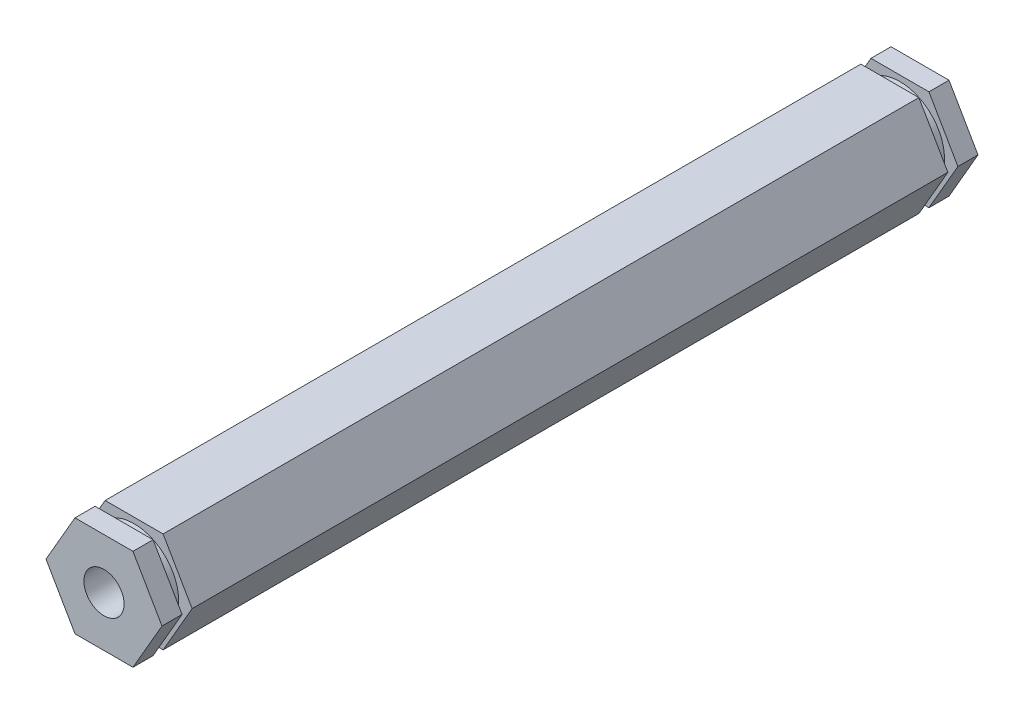
ISO-10303-21;
HEADER;
FILE_DESCRIPTION(('STEP AP214'),'2;1');
FILE_NAME('part.step','',(''),(''),'','','');
FILE_SCHEMA(('AUTOMOTIVE_DESIGN { 1 0 10303 214 1 1 1 1 }'));
ENDSEC;
DATA;
#1=APPLICATION_CONTEXT('core data for automotive mechanical design processes');
#2=APPLICATION_PROTOCOL_DEFINITION('international standard','automotive_design',2000,#1);
#3=PRODUCT_CONTEXT('',#1,'mechanical');
#4=PRODUCT('Part','Part','',(#3));
#5=PRODUCT_RELATED_PRODUCT_CATEGORY('part','',(#4));
#6=PRODUCT_DEFINITION_FORMATION('','',#4);
#7=PRODUCT_DEFINITION_CONTEXT('part definition',#1,'design');
#8=PRODUCT_DEFINITION('design','',#6,#7);
#9=PRODUCT_DEFINITION_SHAPE('','',#8);
#10=(LENGTH_UNIT() NAMED_UNIT(*) SI_UNIT(.MILLI.,.METRE.));
#11=(NAMED_UNIT(*) PLANE_ANGLE_UNIT() SI_UNIT($,.RADIAN.));
#12=(NAMED_UNIT(*) SI_UNIT($,.STERADIAN.) SOLID_ANGLE_UNIT());
#13=UNCERTAINTY_MEASURE_WITH_UNIT(LENGTH_MEASURE(1.E-05),#10,'distance_accuracy_value','');
#14=(GEOMETRIC_REPRESENTATION_CONTEXT(3) GLOBAL_UNCERTAINTY_ASSIGNED_CONTEXT((#13)) GLOBAL_UNIT_ASSIGNED_CONTEXT((#10,
#11,#12)) REPRESENTATION_CONTEXT('',''));
#15=CARTESIAN_POINT('',(0.,0.,0.));
#16=DIRECTION('',(0.,0.,1.));
#17=DIRECTION('',(1.,0.,0.));
#18=AXIS2_PLACEMENT_3D('',#15,#16,#17);
#19=CARTESIAN_POINT('',(3.66617420935412,-6.35000000000001,103.1875));
#20=DIRECTION('',(-0.866025403784439,0.5,0.));
#21=DIRECTION('',(-0.5,-0.866025403784439,0.));
#22=AXIS2_PLACEMENT_3D('',#19,#20,#21);
#23=PLANE('',#22);
#24=DIRECTION('',(0.5,0.866025403784439,0.));
#25=VECTOR('',#24,1.);
#26=CARTESIAN_POINT('',(3.66617420935412,-6.35000000000001,99.3775));
#27=LINE('',#26,#25);
#28=CARTESIAN_POINT('',(3.66617420935412,-6.35000000000001,99.3775));
#29=VERTEX_POINT('',#28);
#30=CARTESIAN_POINT('',(7.33234841870825,0.,99.3775));
#31=VERTEX_POINT('',#30);
#32=EDGE_CURVE('E381',#29,#31,#27,.T.);
#33=ORIENTED_EDGE('',*,*,#32,.F.);
#34=DIRECTION('',(0.,0.,-1.));
#35=VECTOR('',#34,1.);
#36=CARTESIAN_POINT('',(3.66617420935412,-6.35000000000001,103.1875));
#37=LINE('',#36,#35);
#38=CARTESIAN_POINT('',(3.66617420935412,-6.35000000000001,3.80999999999999));
#39=VERTEX_POINT('',#38);
#40=EDGE_CURVE('E244',#29,#39,#37,.T.);
#41=ORIENTED_EDGE('',*,*,#40,.T.);
#42=DIRECTION('',(0.5,0.866025403784439,0.));
#43=VECTOR('',#42,1.);
#44=CARTESIAN_POINT('',(3.66617420935412,-6.35000000000001,3.80999999999999));
#45=LINE('',#44,#43);
#46=CARTESIAN_POINT('',(7.33234841870825,0.,3.80999999999999));
#47=VERTEX_POINT('',#46);
#48=EDGE_CURVE('E272',#39,#47,#45,.T.);
#49=ORIENTED_EDGE('',*,*,#48,.T.);
#50=DIRECTION('',(0.,0.,-1.));
#51=VECTOR('',#50,1.);
#52=CARTESIAN_POINT('',(7.33234841870825,0.,103.1875));
#53=LINE('',#52,#51);
#54=EDGE_CURVE('E334',#31,#47,#53,.T.);
#55=ORIENTED_EDGE('',*,*,#54,.F.);
#56=EDGE_LOOP('',(#33,#41,#49,#55));
#57=FACE_BOUND('',#56,.T.);
#58=ADVANCED_FACE('F39',(#57),#23,.F.);
#59=CARTESIAN_POINT('',(7.33234841870825,0.,103.1875));
#60=DIRECTION('',(-0.866025403784439,-0.5,0.));
#61=DIRECTION('',(0.5,-0.866025403784439,0.));
#62=AXIS2_PLACEMENT_3D('',#59,#60,#61);
#63=PLANE('',#62);
#64=DIRECTION('',(-0.5,0.866025403784439,0.));
#65=VECTOR('',#64,1.);
#66=CARTESIAN_POINT('',(7.33234841870825,0.,99.3775));
#67=LINE('',#66,#65);
#68=CARTESIAN_POINT('',(3.66617420935412,6.35000000000001,99.3775));
#69=VERTEX_POINT('',#68);
#70=EDGE_CURVE('E384',#31,#69,#67,.T.);
#71=ORIENTED_EDGE('',*,*,#70,.F.);
#72=ORIENTED_EDGE('',*,*,#54,.T.);
#73=DIRECTION('',(-0.5,0.866025403784439,0.));
#74=VECTOR('',#73,1.);
#75=CARTESIAN_POINT('',(7.33234841870825,0.,3.80999999999999));
#76=LINE('',#75,#74);
#77=CARTESIAN_POINT('',(3.66617420935412,6.35000000000001,3.80999999999999));
#78=VERTEX_POINT('',#77);
#79=EDGE_CURVE('E370',#47,#78,#76,.T.);
#80=ORIENTED_EDGE('',*,*,#79,.T.);
#81=DIRECTION('',(0.,0.,-1.));
#82=VECTOR('',#81,1.);
#83=CARTESIAN_POINT('',(3.66617420935412,6.35000000000001,103.1875));
#84=LINE('',#83,#82);
#85=EDGE_CURVE('E328',#69,#78,#84,.T.);
#86=ORIENTED_EDGE('',*,*,#85,.F.);
#87=EDGE_LOOP('',(#71,#72,#80,#86));
#88=FACE_BOUND('',#87,.T.);
#89=ADVANCED_FACE('F453',(#88),#63,.F.);
#90=CARTESIAN_POINT('',(3.66617420935412,6.35000000000001,103.1875));
#91=DIRECTION('',(0.,-1.,0.));
#92=DIRECTION('',(0.,0.,-1.));
#93=AXIS2_PLACEMENT_3D('',#90,#91,#92);
#94=PLANE('',#93);
#95=DIRECTION('',(-1.,0.,0.));
#96=VECTOR('',#95,1.);
#97=CARTESIAN_POINT('',(3.66617420935412,6.35000000000001,99.3775));
#98=LINE('',#97,#96);
#99=CARTESIAN_POINT('',(-3.66617420935412,6.35000000000001,99.3775));
#100=VERTEX_POINT('',#99);
#101=EDGE_CURVE('E390',#69,#100,#98,.T.);
#102=ORIENTED_EDGE('',*,*,#101,.F.);
#103=ORIENTED_EDGE('',*,*,#85,.T.);
#104=DIRECTION('',(-1.,0.,0.));
#105=VECTOR('',#104,1.);
#106=CARTESIAN_POINT('',(3.66617420935412,6.35000000000001,3.80999999999999));
#107=LINE('',#106,#105);
#108=CARTESIAN_POINT('',(-3.66617420935412,6.35000000000001,3.80999999999999));
#109=VERTEX_POINT('',#108);
#110=EDGE_CURVE('E361',#78,#109,#107,.T.);
#111=ORIENTED_EDGE('',*,*,#110,.T.);
#112=DIRECTION('',(0.,0.,-1.));
#113=VECTOR('',#112,1.);
#114=CARTESIAN_POINT('',(-3.66617420935412,6.35000000000001,103.1875));
#115=LINE('',#114,#113);
#116=EDGE_CURVE('E316',#100,#109,#115,.T.);
#117=ORIENTED_EDGE('',*,*,#116,.F.);
#118=EDGE_LOOP('',(#102,#103,#111,#117));
#119=FACE_BOUND('',#118,.T.);
#120=ADVANCED_FACE('F432',(#119),#94,.F.);
#121=CARTESIAN_POINT('',(-3.66617420935412,6.35000000000001,103.1875));
#122=DIRECTION('',(0.866025403784439,-0.5,0.));
#123=DIRECTION('',(0.5,0.866025403784439,0.));
#124=AXIS2_PLACEMENT_3D('',#121,#122,#123);
#125=PLANE('',#124);
#126=DIRECTION('',(-0.5,-0.866025403784439,0.));
#127=VECTOR('',#126,1.);
#128=CARTESIAN_POINT('',(-3.66617420935412,6.35000000000001,99.3775));
#129=LINE('',#128,#127);
#130=CARTESIAN_POINT('',(-7.33234841870825,0.,99.3775));
#131=VERTEX_POINT('',#130);
#132=EDGE_CURVE('E437',#100,#131,#129,.T.);
#133=ORIENTED_EDGE('',*,*,#132,.F.);
#134=ORIENTED_EDGE('',*,*,#116,.T.);
#135=DIRECTION('',(-0.5,-0.866025403784439,0.));
#136=VECTOR('',#135,1.);
#137=CARTESIAN_POINT('',(-3.66617420935412,6.35000000000001,3.80999999999999));
#138=LINE('',#137,#136);
#139=CARTESIAN_POINT('',(-7.33234841870825,0.,3.80999999999999));
#140=VERTEX_POINT('',#139);
#141=EDGE_CURVE('E356',#109,#140,#138,.T.);
#142=ORIENTED_EDGE('',*,*,#141,.T.);
#143=DIRECTION('',(0.,0.,-1.));
#144=VECTOR('',#143,1.);
#145=CARTESIAN_POINT('',(-7.33234841870825,0.,103.1875));
#146=LINE('',#145,#144);
#147=EDGE_CURVE('E230',#131,#140,#146,.T.);
#148=ORIENTED_EDGE('',*,*,#147,.F.);
#149=EDGE_LOOP('',(#133,#134,#142,#148));
#150=FACE_BOUND('',#149,.T.);
#151=ADVANCED_FACE('F436',(#150),#125,.F.);
#152=CARTESIAN_POINT('',(-7.33234841870825,0.,103.1875));
#153=DIRECTION('',(0.866025403784438,0.5,0.));
#154=DIRECTION('',(-0.5,0.866025403784439,0.));
#155=AXIS2_PLACEMENT_3D('',#152,#153,#154);
#156=PLANE('',#155);
#157=DIRECTION('',(0.5,-0.866025403784439,0.));
#158=VECTOR('',#157,1.);
#159=CARTESIAN_POINT('',(-7.33234841870825,0.,99.3775));
#160=LINE('',#159,#158);
#161=CARTESIAN_POINT('',(-3.66617420935413,-6.35000000000001,99.3775));
#162=VERTEX_POINT('',#161);
#163=EDGE_CURVE('E68',#131,#162,#160,.T.);
#164=ORIENTED_EDGE('',*,*,#163,.F.);
#165=ORIENTED_EDGE('',*,*,#147,.T.);
#166=DIRECTION('',(0.5,-0.866025403784439,0.));
#167=VECTOR('',#166,1.);
#168=CARTESIAN_POINT('',(-7.33234841870825,0.,3.80999999999999));
#169=LINE('',#168,#167);
#170=CARTESIAN_POINT('',(-3.66617420935413,-6.35000000000001,3.80999999999999));
#171=VERTEX_POINT('',#170);
#172=EDGE_CURVE('E348',#140,#171,#169,.T.);
#173=ORIENTED_EDGE('',*,*,#172,.T.);
#174=DIRECTION('',(0.,0.,-1.));
#175=VECTOR('',#174,1.);
#176=CARTESIAN_POINT('',(-3.66617420935413,-6.35000000000001,103.1875));
#177=LINE('',#176,#175);
#178=EDGE_CURVE('E224',#162,#171,#177,.T.);
#179=ORIENTED_EDGE('',*,*,#178,.F.);
#180=EDGE_LOOP('',(#164,#165,#173,#179));
#181=FACE_BOUND('',#180,.T.);
#182=ADVANCED_FACE('F353',(#181),#156,.F.);
#183=CARTESIAN_POINT('',(-3.66617420935413,-6.35000000000001,103.1875));
#184=DIRECTION('',(0.,1.,0.));
#185=DIRECTION('',(0.,0.,1.));
#186=AXIS2_PLACEMENT_3D('',#183,#184,#185);
#187=PLANE('',#186);
#188=DIRECTION('',(1.,0.,0.));
#189=VECTOR('',#188,1.);
#190=CARTESIAN_POINT('',(-3.66617420935413,-6.35000000000001,99.3775));
#191=LINE('',#190,#189);
#192=EDGE_CURVE('E11',#162,#29,#191,.T.);
#193=ORIENTED_EDGE('',*,*,#192,.F.);
#194=ORIENTED_EDGE('',*,*,#178,.T.);
#195=DIRECTION('',(1.,0.,0.));
#196=VECTOR('',#195,1.);
#197=CARTESIAN_POINT('',(-3.66617420935413,-6.35000000000001,3.80999999999999));
#198=LINE('',#197,#196);
#199=EDGE_CURVE('E206',#171,#39,#198,.T.);
#200=ORIENTED_EDGE('',*,*,#199,.T.);
#201=ORIENTED_EDGE('',*,*,#40,.F.);
#202=EDGE_LOOP('',(#193,#194,#200,#201));
#203=FACE_BOUND('',#202,.T.);
#204=ADVANCED_FACE('F340',(#203),#187,.F.);
#205=CARTESIAN_POINT('',(0.,0.,3.81));
#206=DIRECTION('',(0.,0.,1.));
#207=DIRECTION('',(1.,0.,0.));
#208=AXIS2_PLACEMENT_3D('',#205,#206,#207);
#209=PLANE('',#208);
#210=CARTESIAN_POINT('',(0.,0.,3.81));
#211=DIRECTION('',(0.,0.,1.));
#212=DIRECTION('',(1.,0.,0.));
#213=AXIS2_PLACEMENT_3D('',#210,#211,#212);
#214=CIRCLE('',#213,5.63529717744261);
#215=CARTESIAN_POINT('',(5.63529717744261,0.,3.81));
#216=VERTEX_POINT('',#215);
#217=EDGE_CURVE('E398',#216,#216,#214,.T.);
#218=ORIENTED_EDGE('',*,*,#217,.T.);
#219=EDGE_LOOP('',(#218));
#220=FACE_BOUND('',#219,.T.);
#221=ORIENTED_EDGE('',*,*,#199,.F.);
#222=ORIENTED_EDGE('',*,*,#172,.F.);
#223=ORIENTED_EDGE('',*,*,#141,.F.);
#224=ORIENTED_EDGE('',*,*,#110,.F.);
#225=ORIENTED_EDGE('',*,*,#79,.F.);
#226=ORIENTED_EDGE('',*,*,#48,.F.);
#227=EDGE_LOOP('',(#221,#222,#223,#224,#225,#226));
#228=FACE_BOUND('',#227,.T.);
#229=ADVANCED_FACE('F346',(#220,#228),#209,.F.);
#230=CARTESIAN_POINT('',(0.,0.,2.54));
#231=DIRECTION('',(0.,0.,1.));
#232=DIRECTION('',(1.,0.,0.));
#233=AXIS2_PLACEMENT_3D('',#230,#231,#232);
#234=PLANE('',#233);
#235=CARTESIAN_POINT('',(0.,0.,2.54));
#236=DIRECTION('',(0.,0.,1.));
#237=DIRECTION('',(1.,0.,0.));
#238=AXIS2_PLACEMENT_3D('',#235,#236,#237);
#239=CIRCLE('',#238,5.63529717744261);
#240=CARTESIAN_POINT('',(5.63529717744261,0.,2.54));
#241=VERTEX_POINT('',#240);
#242=EDGE_CURVE('E396',#241,#241,#239,.T.);
#243=ORIENTED_EDGE('',*,*,#242,.F.);
#244=EDGE_LOOP('',(#243));
#245=FACE_BOUND('',#244,.T.);
#246=DIRECTION('',(0.5,0.866025403784439,0.));
#247=VECTOR('',#246,1.);
#248=CARTESIAN_POINT('',(3.66617420935412,-6.35000000000001,2.54));
#249=LINE('',#248,#247);
#250=CARTESIAN_POINT('',(3.66617420935412,-6.35000000000001,2.54));
#251=VERTEX_POINT('',#250);
#252=CARTESIAN_POINT('',(7.33234841870825,0.,2.54));
#253=VERTEX_POINT('',#252);
#254=EDGE_CURVE('E357',#251,#253,#249,.T.);
#255=ORIENTED_EDGE('',*,*,#254,.T.);
#256=DIRECTION('',(-0.5,0.866025403784439,0.));
#257=VECTOR('',#256,1.);
#258=CARTESIAN_POINT('',(7.33234841870825,0.,2.54));
#259=LINE('',#258,#257);
#260=CARTESIAN_POINT('',(3.66617420935412,6.35000000000001,2.54));
#261=VERTEX_POINT('',#260);
#262=EDGE_CURVE('E364',#253,#261,#259,.T.);
#263=ORIENTED_EDGE('',*,*,#262,.T.);
#264=DIRECTION('',(-1.,0.,0.));
#265=VECTOR('',#264,1.);
#266=CARTESIAN_POINT('',(3.66617420935412,6.35000000000001,2.54));
#267=LINE('',#266,#265);
#268=CARTESIAN_POINT('',(-3.66617420935412,6.35000000000001,2.54));
#269=VERTEX_POINT('',#268);
#270=EDGE_CURVE('E409',#261,#269,#267,.T.);
#271=ORIENTED_EDGE('',*,*,#270,.T.);
#272=DIRECTION('',(-0.5,-0.866025403784439,0.));
#273=VECTOR('',#272,1.);
#274=CARTESIAN_POINT('',(-3.66617420935412,6.35000000000001,2.54));
#275=LINE('',#274,#273);
#276=CARTESIAN_POINT('',(-7.33234841870825,0.,2.54));
#277=VERTEX_POINT('',#276);
#278=EDGE_CURVE('E406',#269,#277,#275,.T.);
#279=ORIENTED_EDGE('',*,*,#278,.T.);
#280=DIRECTION('',(0.5,-0.866025403784439,0.));
#281=VECTOR('',#280,1.);
#282=CARTESIAN_POINT('',(-7.33234841870825,0.,2.54));
#283=LINE('',#282,#281);
#284=CARTESIAN_POINT('',(-3.66617420935413,-6.35000000000001,2.54));
#285=VERTEX_POINT('',#284);
#286=EDGE_CURVE('E401',#277,#285,#283,.T.);
#287=ORIENTED_EDGE('',*,*,#286,.T.);
#288=DIRECTION('',(1.,0.,0.));
#289=VECTOR('',#288,1.);
#290=CARTESIAN_POINT('',(-3.66617420935413,-6.35000000000001,2.54));
#291=LINE('',#290,#289);
#292=EDGE_CURVE('E333',#285,#251,#291,.T.);
#293=ORIENTED_EDGE('',*,*,#292,.T.);
#294=EDGE_LOOP('',(#255,#263,#271,#279,#287,#293));
#295=FACE_BOUND('',#294,.T.);
#296=ADVANCED_FACE('F415',(#245,#295),#234,.T.);
#297=CARTESIAN_POINT('',(0.,0.,3.81));
#298=DIRECTION('',(0.,0.,-1.));
#299=DIRECTION('',(-1.,0.,0.));
#300=AXIS2_PLACEMENT_3D('',#297,#298,#299);
#301=CYLINDRICAL_SURFACE('',#300,5.63529717744261);
#302=ORIENTED_EDGE('',*,*,#217,.F.);
#303=EDGE_LOOP('',(#302));
#304=FACE_BOUND('',#303,.T.);
#305=ORIENTED_EDGE('',*,*,#242,.T.);
#306=EDGE_LOOP('',(#305));
#307=FACE_BOUND('',#306,.T.);
#308=ADVANCED_FACE('F500',(#304,#307),#301,.T.);
#309=CARTESIAN_POINT('',(0.,0.,0.));
#310=DIRECTION('',(0.,0.,1.));
#311=DIRECTION('',(1.,0.,0.));
#312=AXIS2_PLACEMENT_3D('',#309,#310,#311);
#313=PLANE('',#312);
#314=CARTESIAN_POINT('',(0.,0.,0.));
#315=DIRECTION('',(0.,0.,-1.));
#316=DIRECTION('',(-1.,0.,0.));
#317=AXIS2_PLACEMENT_3D('',#314,#315,#316);
#318=CIRCLE('',#317,2.54);
#319=CARTESIAN_POINT('',(-2.54,0.,0.));
#320=VERTEX_POINT('',#319);
#321=EDGE_CURVE('E383',#320,#320,#318,.T.);
#322=ORIENTED_EDGE('',*,*,#321,.F.);
#323=EDGE_LOOP('',(#322));
#324=FACE_BOUND('',#323,.T.);
#325=DIRECTION('',(0.5,0.866025403784439,0.));
#326=VECTOR('',#325,1.);
#327=CARTESIAN_POINT('',(3.66617420935412,-6.35000000000001,0.));
#328=LINE('',#327,#326);
#329=CARTESIAN_POINT('',(3.66617420935412,-6.35000000000001,0.));
#330=VERTEX_POINT('',#329);
#331=CARTESIAN_POINT('',(7.33234841870825,0.,0.));
#332=VERTEX_POINT('',#331);
#333=EDGE_CURVE('E268',#330,#332,#328,.T.);
#334=ORIENTED_EDGE('',*,*,#333,.F.);
#335=DIRECTION('',(1.,0.,0.));
#336=VECTOR('',#335,1.);
#337=CARTESIAN_POINT('',(-3.66617420935413,-6.35000000000001,0.));
#338=LINE('',#337,#336);
#339=CARTESIAN_POINT('',(-3.66617420935413,-6.35000000000001,0.));
#340=VERTEX_POINT('',#339);
#341=EDGE_CURVE('E286',#340,#330,#338,.T.);
#342=ORIENTED_EDGE('',*,*,#341,.F.);
#343=DIRECTION('',(0.5,-0.866025403784439,0.));
#344=VECTOR('',#343,1.);
#345=CARTESIAN_POINT('',(-7.33234841870825,0.,0.));
#346=LINE('',#345,#344);
#347=CARTESIAN_POINT('',(-7.33234841870825,0.,0.));
#348=VERTEX_POINT('',#347);
#349=EDGE_CURVE('E284',#348,#340,#346,.T.);
#350=ORIENTED_EDGE('',*,*,#349,.F.);
#351=DIRECTION('',(-0.5,-0.866025403784439,0.));
#352=VECTOR('',#351,1.);
#353=CARTESIAN_POINT('',(-3.66617420935412,6.35000000000001,0.));
#354=LINE('',#353,#352);
#355=CARTESIAN_POINT('',(-3.66617420935412,6.35000000000001,0.));
#356=VERTEX_POINT('',#355);
#357=EDGE_CURVE('E280',#356,#348,#354,.T.);
#358=ORIENTED_EDGE('',*,*,#357,.F.);
#359=DIRECTION('',(-1.,0.,0.));
#360=VECTOR('',#359,1.);
#361=CARTESIAN_POINT('',(3.66617420935412,6.35000000000001,0.));
#362=LINE('',#361,#360);
#363=CARTESIAN_POINT('',(3.66617420935412,6.35000000000001,0.));
#364=VERTEX_POINT('',#363);
#365=EDGE_CURVE('E276',#364,#356,#362,.T.);
#366=ORIENTED_EDGE('',*,*,#365,.F.);
#367=DIRECTION('',(-0.5,0.866025403784438,0.));
#368=VECTOR('',#367,1.);
#369=CARTESIAN_POINT('',(7.33234841870825,0.,0.));
#370=LINE('',#369,#368);
#371=EDGE_CURVE('E271',#332,#364,#370,.T.);
#372=ORIENTED_EDGE('',*,*,#371,.F.);
#373=EDGE_LOOP('',(#334,#342,#350,#358,#366,#372));
#374=FACE_BOUND('',#373,.T.);
#375=ADVANCED_FACE('F440',(#324,#374),#313,.F.);
#376=ORIENTED_EDGE('',*,*,#292,.F.);
#377=EDGE_CURVE('E226',#285,#340,#177,.T.);
#378=ORIENTED_EDGE('',*,*,#377,.T.);
#379=ORIENTED_EDGE('',*,*,#341,.T.);
#380=EDGE_CURVE('E245',#251,#330,#37,.T.);
#381=ORIENTED_EDGE('',*,*,#380,.F.);
#382=EDGE_LOOP('',(#376,#378,#379,#381));
#383=FACE_BOUND('',#382,.T.);
#384=ADVANCED_FACE('F515',(#383),#187,.F.);
#385=ORIENTED_EDGE('',*,*,#286,.F.);
#386=EDGE_CURVE('E223',#277,#348,#146,.T.);
#387=ORIENTED_EDGE('',*,*,#386,.T.);
#388=ORIENTED_EDGE('',*,*,#349,.T.);
#389=ORIENTED_EDGE('',*,*,#377,.F.);
#390=EDGE_LOOP('',(#385,#387,#388,#389));
#391=FACE_BOUND('',#390,.T.);
#392=ADVANCED_FACE('F521',(#391),#156,.F.);
#393=ORIENTED_EDGE('',*,*,#278,.F.);
#394=EDGE_CURVE('E313',#269,#356,#115,.T.);
#395=ORIENTED_EDGE('',*,*,#394,.T.);
#396=ORIENTED_EDGE('',*,*,#357,.T.);
#397=ORIENTED_EDGE('',*,*,#386,.F.);
#398=EDGE_LOOP('',(#393,#395,#396,#397));
#399=FACE_BOUND('',#398,.T.);
#400=ADVANCED_FACE('F523',(#399),#125,.F.);
#401=ORIENTED_EDGE('',*,*,#270,.F.);
#402=EDGE_CURVE('E322',#261,#364,#84,.T.);
#403=ORIENTED_EDGE('',*,*,#402,.T.);
#404=ORIENTED_EDGE('',*,*,#365,.T.);
#405=ORIENTED_EDGE('',*,*,#394,.F.);
#406=EDGE_LOOP('',(#401,#403,#404,#405));
#407=FACE_BOUND('',#406,.T.);
#408=ADVANCED_FACE('F422',(#407),#94,.F.);
#409=ORIENTED_EDGE('',*,*,#262,.F.);
#410=EDGE_CURVE('E327',#253,#332,#53,.T.);
#411=ORIENTED_EDGE('',*,*,#410,.T.);
#412=ORIENTED_EDGE('',*,*,#371,.T.);
#413=ORIENTED_EDGE('',*,*,#402,.F.);
#414=EDGE_LOOP('',(#409,#411,#412,#413));
#415=FACE_BOUND('',#414,.T.);
#416=ADVANCED_FACE('F423',(#415),#63,.F.);
#417=ORIENTED_EDGE('',*,*,#254,.F.);
#418=ORIENTED_EDGE('',*,*,#380,.T.);
#419=ORIENTED_EDGE('',*,*,#333,.T.);
#420=ORIENTED_EDGE('',*,*,#410,.F.);
#421=EDGE_LOOP('',(#417,#418,#419,#420));
#422=FACE_BOUND('',#421,.T.);
#423=ADVANCED_FACE('F442',(#422),#23,.F.);
#424=CARTESIAN_POINT('',(0.,0.,25.4));
#425=DIRECTION('',(0.,0.,-1.));
#426=DIRECTION('',(-1.,0.,0.));
#427=AXIS2_PLACEMENT_3D('',#424,#425,#426);
#428=CYLINDRICAL_SURFACE('',#427,2.54);
#429=CARTESIAN_POINT('',(0.,0.,25.4));
#430=DIRECTION('',(0.,0.,-1.));
#431=DIRECTION('',(-1.,0.,0.));
#432=AXIS2_PLACEMENT_3D('',#429,#430,#431);
#433=CIRCLE('',#432,2.54);
#434=CARTESIAN_POINT('',(-2.54,0.,25.4));
#435=VERTEX_POINT('',#434);
#436=EDGE_CURVE('E388',#435,#435,#433,.T.);
#437=ORIENTED_EDGE('',*,*,#436,.F.);
#438=EDGE_LOOP('',(#437));
#439=FACE_BOUND('',#438,.T.);
#440=ORIENTED_EDGE('',*,*,#321,.T.);
#441=EDGE_LOOP('',(#440));
#442=FACE_BOUND('',#441,.T.);
#443=ADVANCED_FACE('F444',(#439,#442),#428,.F.);
#444=CARTESIAN_POINT('',(0.,0.,25.4));
#445=DIRECTION('',(0.,0.,-1.));
#446=DIRECTION('',(-1.,0.,0.));
#447=AXIS2_PLACEMENT_3D('',#444,#445,#446);
#448=PLANE('',#447);
#449=ORIENTED_EDGE('',*,*,#436,.T.);
#450=EDGE_LOOP('',(#449));
#451=FACE_BOUND('',#450,.T.);
#452=ADVANCED_FACE('F449',(#451),#448,.T.);
#453=CARTESIAN_POINT('',(0.,0.,99.3775));
#454=DIRECTION('',(0.,0.,1.));
#455=DIRECTION('',(1.,0.,0.));
#456=AXIS2_PLACEMENT_3D('',#453,#454,#455);
#457=PLANE('',#456);
#458=CARTESIAN_POINT('',(0.,0.,99.3775));
#459=DIRECTION('',(0.,0.,1.));
#460=DIRECTION('',(1.,0.,0.));
#461=AXIS2_PLACEMENT_3D('',#458,#459,#460);
#462=CIRCLE('',#461,5.63529717744261);
#463=CARTESIAN_POINT('',(5.63529717744261,0.,99.3775));
#464=VERTEX_POINT('',#463);
#465=EDGE_CURVE('E218',#464,#464,#462,.T.);
#466=ORIENTED_EDGE('',*,*,#465,.F.);
#467=EDGE_LOOP('',(#466));
#468=FACE_BOUND('',#467,.T.);
#469=ORIENTED_EDGE('',*,*,#32,.T.);
#470=ORIENTED_EDGE('',*,*,#70,.T.);
#471=ORIENTED_EDGE('',*,*,#101,.T.);
#472=ORIENTED_EDGE('',*,*,#132,.T.);
#473=ORIENTED_EDGE('',*,*,#163,.T.);
#474=ORIENTED_EDGE('',*,*,#192,.T.);
#475=EDGE_LOOP('',(#469,#470,#471,#472,#473,#474));
#476=FACE_BOUND('',#475,.T.);
#477=ADVANCED_FACE('F483',(#468,#476),#457,.T.);
#478=CARTESIAN_POINT('',(0.,0.,100.6475));
#479=DIRECTION('',(0.,0.,1.));
#480=DIRECTION('',(1.,0.,0.));
#481=AXIS2_PLACEMENT_3D('',#478,#479,#480);
#482=PLANE('',#481);
#483=CARTESIAN_POINT('',(0.,0.,100.6475));
#484=DIRECTION('',(0.,0.,1.));
#485=DIRECTION('',(1.,0.,0.));
#486=AXIS2_PLACEMENT_3D('',#483,#484,#485);
#487=CIRCLE('',#486,5.63529717744261);
#488=CARTESIAN_POINT('',(5.63529717744261,0.,100.6475));
#489=VERTEX_POINT('',#488);
#490=EDGE_CURVE('E628',#489,#489,#487,.T.);
#491=ORIENTED_EDGE('',*,*,#490,.T.);
#492=EDGE_LOOP('',(#491));
#493=FACE_BOUND('',#492,.T.);
#494=DIRECTION('',(1.,0.,0.));
#495=VECTOR('',#494,1.);
#496=CARTESIAN_POINT('',(-3.66617420935413,-6.35000000000001,100.6475));
#497=LINE('',#496,#495);
#498=CARTESIAN_POINT('',(-3.66617420935413,-6.35000000000001,100.6475));
#499=VERTEX_POINT('',#498);
#500=CARTESIAN_POINT('',(3.66617420935412,-6.35000000000001,100.6475));
#501=VERTEX_POINT('',#500);
#502=EDGE_CURVE('E48',#499,#501,#497,.T.);
#503=ORIENTED_EDGE('',*,*,#502,.F.);
#504=DIRECTION('',(0.5,-0.866025403784439,0.));
#505=VECTOR('',#504,1.);
#506=CARTESIAN_POINT('',(-7.33234841870825,0.,100.6475));
#507=LINE('',#506,#505);
#508=CARTESIAN_POINT('',(-7.33234841870825,0.,100.6475));
#509=VERTEX_POINT('',#508);
#510=EDGE_CURVE('E199',#509,#499,#507,.T.);
#511=ORIENTED_EDGE('',*,*,#510,.F.);
#512=DIRECTION('',(-0.5,-0.866025403784439,0.));
#513=VECTOR('',#512,1.);
#514=CARTESIAN_POINT('',(-3.66617420935412,6.35000000000001,100.6475));
#515=LINE('',#514,#513);
#516=CARTESIAN_POINT('',(-3.66617420935412,6.35000000000001,100.6475));
#517=VERTEX_POINT('',#516);
#518=EDGE_CURVE('E217',#517,#509,#515,.T.);
#519=ORIENTED_EDGE('',*,*,#518,.F.);
#520=DIRECTION('',(-1.,0.,0.));
#521=VECTOR('',#520,1.);
#522=CARTESIAN_POINT('',(3.66617420935412,6.35000000000001,100.6475));
#523=LINE('',#522,#521);
#524=CARTESIAN_POINT('',(3.66617420935412,6.35000000000001,100.6475));
#525=VERTEX_POINT('',#524);
#526=EDGE_CURVE('E477',#525,#517,#523,.T.);
#527=ORIENTED_EDGE('',*,*,#526,.F.);
#528=DIRECTION('',(-0.5,0.866025403784439,0.));
#529=VECTOR('',#528,1.);
#530=CARTESIAN_POINT('',(7.33234841870825,0.,100.6475));
#531=LINE('',#530,#529);
#532=CARTESIAN_POINT('',(7.33234841870825,0.,100.6475));
#533=VERTEX_POINT('',#532);
#534=EDGE_CURVE('E473',#533,#525,#531,.T.);
#535=ORIENTED_EDGE('',*,*,#534,.F.);
#536=DIRECTION('',(0.5,0.866025403784439,0.));
#537=VECTOR('',#536,1.);
#538=CARTESIAN_POINT('',(3.66617420935412,-6.35000000000001,100.6475));
#539=LINE('',#538,#537);
#540=EDGE_CURVE('E58',#501,#533,#539,.T.);
#541=ORIENTED_EDGE('',*,*,#540,.F.);
#542=EDGE_LOOP('',(#503,#511,#519,#527,#535,#541));
#543=FACE_BOUND('',#542,.T.);
#544=ADVANCED_FACE('F198',(#493,#543),#482,.F.);
#545=CARTESIAN_POINT('',(0.,0.,99.3775));
#546=DIRECTION('',(0.,0.,1.));
#547=DIRECTION('',(1.,0.,0.));
#548=AXIS2_PLACEMENT_3D('',#545,#546,#547);
#549=CYLINDRICAL_SURFACE('',#548,5.63529717744261);
#550=ORIENTED_EDGE('',*,*,#465,.T.);
#551=EDGE_LOOP('',(#550));
#552=FACE_BOUND('',#551,.T.);
#553=ORIENTED_EDGE('',*,*,#490,.F.);
#554=EDGE_LOOP('',(#553));
#555=FACE_BOUND('',#554,.T.);
#556=ADVANCED_FACE('F491',(#552,#555),#549,.T.);
#557=CARTESIAN_POINT('',(0.,0.,103.1875));
#558=DIRECTION('',(0.,0.,1.));
#559=DIRECTION('',(1.,0.,0.));
#560=AXIS2_PLACEMENT_3D('',#557,#558,#559);
#561=PLANE('',#560);
#562=CARTESIAN_POINT('',(0.,0.,103.1875));
#563=DIRECTION('',(0.,0.,1.));
#564=DIRECTION('',(1.,0.,0.));
#565=AXIS2_PLACEMENT_3D('',#562,#563,#564);
#566=CIRCLE('',#565,2.54);
#567=CARTESIAN_POINT('',(2.54,0.,103.1875));
#568=VERTEX_POINT('',#567);
#569=EDGE_CURVE('E625',#568,#568,#566,.T.);
#570=ORIENTED_EDGE('',*,*,#569,.F.);
#571=EDGE_LOOP('',(#570));
#572=FACE_BOUND('',#571,.T.);
#573=DIRECTION('',(0.5,0.866025403784439,0.));
#574=VECTOR('',#573,1.);
#575=CARTESIAN_POINT('',(3.66617420935412,-6.35000000000001,103.1875));
#576=LINE('',#575,#574);
#577=CARTESIAN_POINT('',(3.66617420935412,-6.35000000000001,103.1875));
#578=VERTEX_POINT('',#577);
#579=CARTESIAN_POINT('',(7.33234841870825,0.,103.1875));
#580=VERTEX_POINT('',#579);
#581=EDGE_CURVE('E288',#578,#580,#576,.T.);
#582=ORIENTED_EDGE('',*,*,#581,.T.);
#583=DIRECTION('',(-0.5,0.866025403784438,0.));
#584=VECTOR('',#583,1.);
#585=CARTESIAN_POINT('',(7.33234841870825,0.,103.1875));
#586=LINE('',#585,#584);
#587=CARTESIAN_POINT('',(3.66617420935412,6.35000000000001,103.1875));
#588=VERTEX_POINT('',#587);
#589=EDGE_CURVE('E292',#580,#588,#586,.T.);
#590=ORIENTED_EDGE('',*,*,#589,.T.);
#591=DIRECTION('',(-1.,0.,0.));
#592=VECTOR('',#591,1.);
#593=CARTESIAN_POINT('',(3.66617420935412,6.35000000000001,103.1875));
#594=LINE('',#593,#592);
#595=CARTESIAN_POINT('',(-3.66617420935412,6.35000000000001,103.1875));
#596=VERTEX_POINT('',#595);
#597=EDGE_CURVE('E296',#588,#596,#594,.T.);
#598=ORIENTED_EDGE('',*,*,#597,.T.);
#599=DIRECTION('',(-0.5,-0.866025403784439,0.));
#600=VECTOR('',#599,1.);
#601=CARTESIAN_POINT('',(-3.66617420935412,6.35000000000001,103.1875));
#602=LINE('',#601,#600);
#603=CARTESIAN_POINT('',(-7.33234841870825,0.,103.1875));
#604=VERTEX_POINT('',#603);
#605=EDGE_CURVE('E264',#596,#604,#602,.T.);
#606=ORIENTED_EDGE('',*,*,#605,.T.);
#607=DIRECTION('',(0.5,-0.866025403784439,0.));
#608=VECTOR('',#607,1.);
#609=CARTESIAN_POINT('',(-7.33234841870825,0.,103.1875));
#610=LINE('',#609,#608);
#611=CARTESIAN_POINT('',(-3.66617420935413,-6.35000000000001,103.1875));
#612=VERTEX_POINT('',#611);
#613=EDGE_CURVE('E260',#604,#612,#610,.T.);
#614=ORIENTED_EDGE('',*,*,#613,.T.);
#615=DIRECTION('',(1.,0.,0.));
#616=VECTOR('',#615,1.);
#617=CARTESIAN_POINT('',(-3.66617420935413,-6.35000000000001,103.1875));
#618=LINE('',#617,#616);
#619=EDGE_CURVE('E221',#612,#578,#618,.T.);
#620=ORIENTED_EDGE('',*,*,#619,.T.);
#621=EDGE_LOOP('',(#582,#590,#598,#606,#614,#620));
#622=FACE_BOUND('',#621,.T.);
#623=ADVANCED_FACE('F306',(#572,#622),#561,.T.);
#624=EDGE_CURVE('E212',#612,#499,#177,.T.);
#625=ORIENTED_EDGE('',*,*,#624,.T.);
#626=ORIENTED_EDGE('',*,*,#502,.T.);
#627=EDGE_CURVE('E235',#578,#501,#37,.T.);
#628=ORIENTED_EDGE('',*,*,#627,.F.);
#629=ORIENTED_EDGE('',*,*,#619,.F.);
#630=EDGE_LOOP('',(#625,#626,#628,#629));
#631=FACE_BOUND('',#630,.T.);
#632=ADVANCED_FACE('F220',(#631),#187,.F.);
#633=EDGE_CURVE('E215',#604,#509,#146,.T.);
#634=ORIENTED_EDGE('',*,*,#633,.T.);
#635=ORIENTED_EDGE('',*,*,#510,.T.);
#636=ORIENTED_EDGE('',*,*,#624,.F.);
#637=ORIENTED_EDGE('',*,*,#613,.F.);
#638=EDGE_LOOP('',(#634,#635,#636,#637));
#639=FACE_BOUND('',#638,.T.);
#640=ADVANCED_FACE('F210',(#639),#156,.F.);
#641=EDGE_CURVE('E318',#596,#517,#115,.T.);
#642=ORIENTED_EDGE('',*,*,#641,.T.);
#643=ORIENTED_EDGE('',*,*,#518,.T.);
#644=ORIENTED_EDGE('',*,*,#633,.F.);
#645=ORIENTED_EDGE('',*,*,#605,.F.);
#646=EDGE_LOOP('',(#642,#643,#644,#645));
#647=FACE_BOUND('',#646,.T.);
#648=ADVANCED_FACE('F311',(#647),#125,.F.);
#649=EDGE_CURVE('E323',#588,#525,#84,.T.);
#650=ORIENTED_EDGE('',*,*,#649,.T.);
#651=ORIENTED_EDGE('',*,*,#526,.T.);
#652=ORIENTED_EDGE('',*,*,#641,.F.);
#653=ORIENTED_EDGE('',*,*,#597,.F.);
#654=EDGE_LOOP('',(#650,#651,#652,#653));
#655=FACE_BOUND('',#654,.T.);
#656=ADVANCED_FACE('F464',(#655),#94,.F.);
#657=EDGE_CURVE('E329',#580,#533,#53,.T.);
#658=ORIENTED_EDGE('',*,*,#657,.T.);
#659=ORIENTED_EDGE('',*,*,#534,.T.);
#660=ORIENTED_EDGE('',*,*,#649,.F.);
#661=ORIENTED_EDGE('',*,*,#589,.F.);
#662=EDGE_LOOP('',(#658,#659,#660,#661));
#663=FACE_BOUND('',#662,.T.);
#664=ADVANCED_FACE('F452',(#663),#63,.F.);
#665=ORIENTED_EDGE('',*,*,#627,.T.);
#666=ORIENTED_EDGE('',*,*,#540,.T.);
#667=ORIENTED_EDGE('',*,*,#657,.F.);
#668=ORIENTED_EDGE('',*,*,#581,.F.);
#669=EDGE_LOOP('',(#665,#666,#667,#668));
#670=FACE_BOUND('',#669,.T.);
#671=ADVANCED_FACE('F41',(#670),#23,.F.);
#672=CARTESIAN_POINT('',(0.,0.,77.7875));
#673=DIRECTION('',(0.,0.,1.));
#674=DIRECTION('',(1.,0.,0.));
#675=AXIS2_PLACEMENT_3D('',#672,#673,#674);
#676=CYLINDRICAL_SURFACE('',#675,2.54);
#677=CARTESIAN_POINT('',(0.,0.,77.7875));
#678=DIRECTION('',(0.,0.,1.));
#679=DIRECTION('',(1.,0.,0.));
#680=AXIS2_PLACEMENT_3D('',#677,#678,#679);
#681=CIRCLE('',#680,2.54);
#682=CARTESIAN_POINT('',(2.54,0.,77.7875));
#683=VERTEX_POINT('',#682);
#684=EDGE_CURVE('E622',#683,#683,#681,.T.);
#685=ORIENTED_EDGE('',*,*,#684,.F.);
#686=EDGE_LOOP('',(#685));
#687=FACE_BOUND('',#686,.T.);
#688=ORIENTED_EDGE('',*,*,#569,.T.);
#689=EDGE_LOOP('',(#688));
#690=FACE_BOUND('',#689,.T.);
#691=ADVANCED_FACE('F455',(#687,#690),#676,.F.);
#692=CARTESIAN_POINT('',(0.,0.,77.7875));
#693=DIRECTION('',(0.,0.,1.));
#694=DIRECTION('',(1.,0.,0.));
#695=AXIS2_PLACEMENT_3D('',#692,#693,#694);
#696=PLANE('',#695);
#697=ORIENTED_EDGE('',*,*,#684,.T.);
#698=EDGE_LOOP('',(#697));
#699=FACE_BOUND('',#698,.T.);
#700=ADVANCED_FACE('F593',(#699),#696,.T.);
#701=CLOSED_SHELL('',(#58,#89,#120,#151,#182,#204,#229,#296,#308,#375,#384,#392,#400,#408,#416,
#423,#443,#452,#477,#544,#556,#623,#632,#640,#648,#656,#664,#671,#691,#700));
#702=MANIFOLD_SOLID_BREP('B2',#701);
#703=ADVANCED_BREP_SHAPE_REPRESENTATION('',(#18,#702),#14);
#704=SHAPE_DEFINITION_REPRESENTATION(#9,#703);
ENDSEC;
END-ISO-10303-21;
